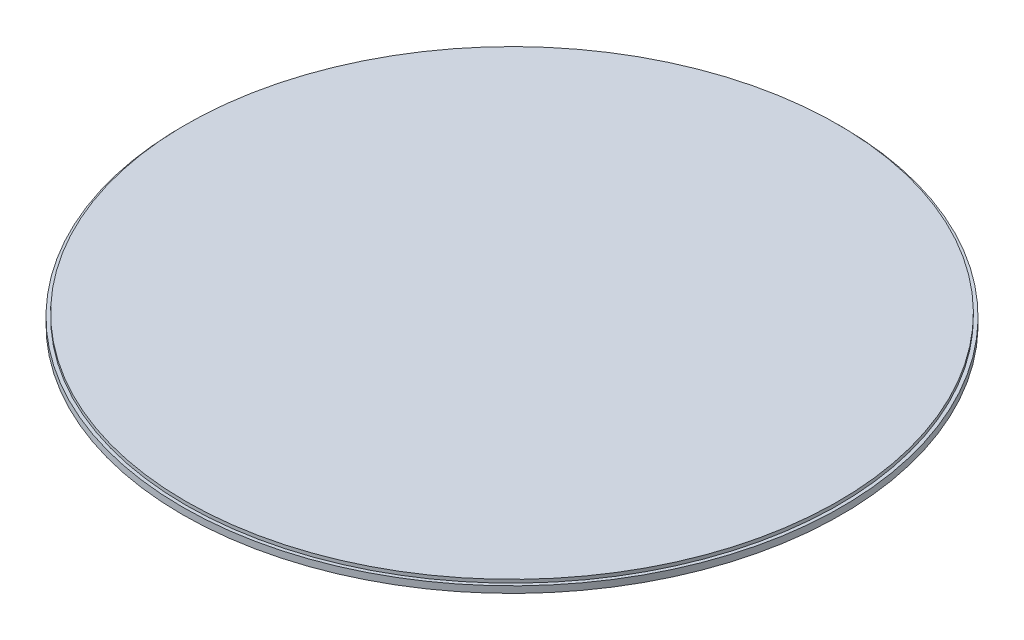
ISO-10303-21;
HEADER;
FILE_DESCRIPTION(('STEP AP214'),'2;1');
FILE_NAME('part.step','',(''),(''),'','','');
FILE_SCHEMA(('AUTOMOTIVE_DESIGN { 1 0 10303 214 1 1 1 1 }'));
ENDSEC;
DATA;
#1=APPLICATION_CONTEXT('core data for automotive mechanical design processes');
#2=APPLICATION_PROTOCOL_DEFINITION('international standard','automotive_design',2000,#1);
#3=PRODUCT_CONTEXT('',#1,'mechanical');
#4=PRODUCT('Part','Part','',(#3));
#5=PRODUCT_RELATED_PRODUCT_CATEGORY('part','',(#4));
#6=PRODUCT_DEFINITION_FORMATION('','',#4);
#7=PRODUCT_DEFINITION_CONTEXT('part definition',#1,'design');
#8=PRODUCT_DEFINITION('design','',#6,#7);
#9=PRODUCT_DEFINITION_SHAPE('','',#8);
#10=(LENGTH_UNIT() NAMED_UNIT(*) SI_UNIT(.MILLI.,.METRE.));
#11=(NAMED_UNIT(*) PLANE_ANGLE_UNIT() SI_UNIT($,.RADIAN.));
#12=(NAMED_UNIT(*) SI_UNIT($,.STERADIAN.) SOLID_ANGLE_UNIT());
#13=UNCERTAINTY_MEASURE_WITH_UNIT(LENGTH_MEASURE(1.E-05),#10,'distance_accuracy_value','');
#14=(GEOMETRIC_REPRESENTATION_CONTEXT(3) GLOBAL_UNCERTAINTY_ASSIGNED_CONTEXT((#13)) GLOBAL_UNIT_ASSIGNED_CONTEXT((#10,
#11,#12)) REPRESENTATION_CONTEXT('',''));
#15=CARTESIAN_POINT('',(0.,0.,0.));
#16=DIRECTION('',(0.,0.,1.));
#17=DIRECTION('',(1.,0.,0.));
#18=AXIS2_PLACEMENT_3D('',#15,#16,#17);
#19=CARTESIAN_POINT('',(0.,2.,0.));
#20=DIRECTION('',(0.,1.,0.));
#21=DIRECTION('',(0.,0.,1.));
#22=AXIS2_PLACEMENT_3D('',#19,#20,#21);
#23=PLANE('',#22);
#24=CARTESIAN_POINT('',(0.,2.,0.));
#25=DIRECTION('',(0.,1.,0.));
#26=DIRECTION('',(0.,0.,1.));
#27=AXIS2_PLACEMENT_3D('',#24,#25,#26);
#28=CIRCLE('',#27,100.);
#29=CARTESIAN_POINT('',(0.,2.,100.));
#30=VERTEX_POINT('',#29);
#31=EDGE_CURVE('E10',#30,#30,#28,.T.);
#32=ORIENTED_EDGE('',*,*,#31,.T.);
#33=EDGE_LOOP('',(#32));
#34=FACE_BOUND('',#33,.T.);
#35=CARTESIAN_POINT('',(0.,2.,0.));
#36=DIRECTION('',(0.,1.,0.));
#37=DIRECTION('',(0.,0.,1.));
#38=AXIS2_PLACEMENT_3D('',#35,#36,#37);
#39=CIRCLE('',#38,99.);
#40=CARTESIAN_POINT('',(0.,2.,99.));
#41=VERTEX_POINT('',#40);
#42=EDGE_CURVE('E52',#41,#41,#39,.T.);
#43=ORIENTED_EDGE('',*,*,#42,.F.);
#44=EDGE_LOOP('',(#43));
#45=FACE_BOUND('',#44,.T.);
#46=ADVANCED_FACE('F39',(#34,#45),#23,.T.);
#47=CARTESIAN_POINT('',(0.,0.,0.));
#48=DIRECTION('',(0.,1.,0.));
#49=DIRECTION('',(0.,0.,1.));
#50=AXIS2_PLACEMENT_3D('',#47,#48,#49);
#51=PLANE('',#50);
#52=CARTESIAN_POINT('',(0.,0.,0.));
#53=DIRECTION('',(0.,1.,0.));
#54=DIRECTION('',(0.,0.,1.));
#55=AXIS2_PLACEMENT_3D('',#52,#53,#54);
#56=CIRCLE('',#55,100.);
#57=CARTESIAN_POINT('',(0.,0.,100.));
#58=VERTEX_POINT('',#57);
#59=EDGE_CURVE('E43',#58,#58,#56,.T.);
#60=ORIENTED_EDGE('',*,*,#59,.F.);
#61=EDGE_LOOP('',(#60));
#62=FACE_BOUND('',#61,.T.);
#63=ADVANCED_FACE('F73',(#62),#51,.F.);
#64=CARTESIAN_POINT('',(0.,2.,0.));
#65=DIRECTION('',(0.,-1.,0.));
#66=DIRECTION('',(0.,0.,-1.));
#67=AXIS2_PLACEMENT_3D('',#64,#65,#66);
#68=CYLINDRICAL_SURFACE('',#67,100.);
#69=ORIENTED_EDGE('',*,*,#31,.F.);
#70=EDGE_LOOP('',(#69));
#71=FACE_BOUND('',#70,.T.);
#72=ORIENTED_EDGE('',*,*,#59,.T.);
#73=EDGE_LOOP('',(#72));
#74=FACE_BOUND('',#73,.T.);
#75=ADVANCED_FACE('F41',(#71,#74),#68,.T.);
#76=CARTESIAN_POINT('',(0.,3.,0.));
#77=DIRECTION('',(0.,-1.,0.));
#78=DIRECTION('',(0.,0.,-1.));
#79=AXIS2_PLACEMENT_3D('',#76,#77,#78);
#80=CYLINDRICAL_SURFACE('',#79,99.);
#81=ORIENTED_EDGE('',*,*,#42,.T.);
#82=EDGE_LOOP('',(#81));
#83=FACE_BOUND('',#82,.T.);
#84=CARTESIAN_POINT('',(0.,3.,0.));
#85=DIRECTION('',(0.,1.,0.));
#86=DIRECTION('',(0.,0.,1.));
#87=AXIS2_PLACEMENT_3D('',#84,#85,#86);
#88=CIRCLE('',#87,99.);
#89=CARTESIAN_POINT('',(0.,3.,99.));
#90=VERTEX_POINT('',#89);
#91=EDGE_CURVE('E57',#90,#90,#88,.T.);
#92=ORIENTED_EDGE('',*,*,#91,.F.);
#93=EDGE_LOOP('',(#92));
#94=FACE_BOUND('',#93,.T.);
#95=ADVANCED_FACE('F64',(#83,#94),#80,.T.);
#96=CARTESIAN_POINT('',(0.,3.,0.));
#97=DIRECTION('',(0.,1.,0.));
#98=DIRECTION('',(0.,0.,1.));
#99=AXIS2_PLACEMENT_3D('',#96,#97,#98);
#100=PLANE('',#99);
#101=ORIENTED_EDGE('',*,*,#91,.T.);
#102=EDGE_LOOP('',(#101));
#103=FACE_BOUND('',#102,.T.);
#104=ADVANCED_FACE('F62',(#103),#100,.T.);
#105=CLOSED_SHELL('',(#46,#63,#75,#95,#104));
#106=MANIFOLD_SOLID_BREP('B2',#105);
#107=ADVANCED_BREP_SHAPE_REPRESENTATION('',(#18,#106),#14);
#108=SHAPE_DEFINITION_REPRESENTATION(#9,#107);
ENDSEC;
END-ISO-10303-21;
